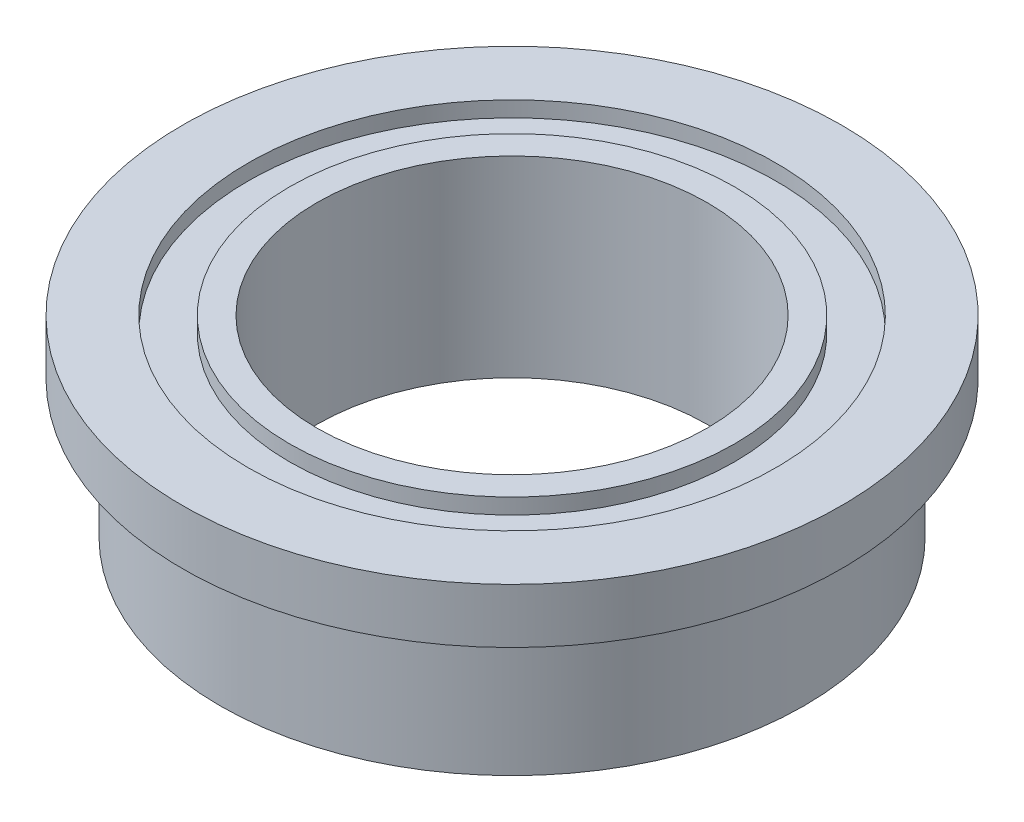
ISO-10303-21;
HEADER;
FILE_DESCRIPTION(('STEP AP214'),'2;1');
FILE_NAME('part.step','',(''),(''),'','','');
FILE_SCHEMA(('AUTOMOTIVE_DESIGN { 1 0 10303 214 1 1 1 1 }'));
ENDSEC;
DATA;
#1=APPLICATION_CONTEXT('core data for automotive mechanical design processes');
#2=APPLICATION_PROTOCOL_DEFINITION('international standard','automotive_design',2000,#1);
#3=PRODUCT_CONTEXT('',#1,'mechanical');
#4=PRODUCT('Part','Part','',(#3));
#5=PRODUCT_RELATED_PRODUCT_CATEGORY('part','',(#4));
#6=PRODUCT_DEFINITION_FORMATION('','',#4);
#7=PRODUCT_DEFINITION_CONTEXT('part definition',#1,'design');
#8=PRODUCT_DEFINITION('design','',#6,#7);
#9=PRODUCT_DEFINITION_SHAPE('','',#8);
#10=(LENGTH_UNIT() NAMED_UNIT(*) SI_UNIT(.MILLI.,.METRE.));
#11=(NAMED_UNIT(*) PLANE_ANGLE_UNIT() SI_UNIT($,.RADIAN.));
#12=(NAMED_UNIT(*) SI_UNIT($,.STERADIAN.) SOLID_ANGLE_UNIT());
#13=UNCERTAINTY_MEASURE_WITH_UNIT(LENGTH_MEASURE(1.E-05),#10,'distance_accuracy_value','');
#14=(GEOMETRIC_REPRESENTATION_CONTEXT(3) GLOBAL_UNCERTAINTY_ASSIGNED_CONTEXT((#13)) GLOBAL_UNIT_ASSIGNED_CONTEXT((#10,
#11,#12)) REPRESENTATION_CONTEXT('',''));
#15=CARTESIAN_POINT('',(0.,0.,0.));
#16=DIRECTION('',(0.,0.,1.));
#17=DIRECTION('',(1.,0.,0.));
#18=AXIS2_PLACEMENT_3D('',#15,#16,#17);
#19=CARTESIAN_POINT('',(0.,3.1242,0.));
#20=DIRECTION('',(0.,1.,0.));
#21=DIRECTION('',(0.,0.,1.));
#22=AXIS2_PLACEMENT_3D('',#19,#20,#21);
#23=PLANE('',#22);
#24=CARTESIAN_POINT('',(0.,3.1242,0.));
#25=DIRECTION('',(0.,1.,0.));
#26=DIRECTION('',(0.,0.,1.));
#27=AXIS2_PLACEMENT_3D('',#24,#25,#26);
#28=CIRCLE('',#27,3.6195);
#29=CARTESIAN_POINT('',(0.,3.1242,3.6195));
#30=VERTEX_POINT('',#29);
#31=EDGE_CURVE('E18',#30,#30,#28,.F.);
#32=ORIENTED_EDGE('',*,*,#31,.F.);
#33=EDGE_LOOP('',(#32));
#34=FACE_BOUND('',#33,.T.);
#35=CARTESIAN_POINT('',(0.,3.1242,0.));
#36=DIRECTION('',(0.,1.,0.));
#37=DIRECTION('',(0.,0.,1.));
#38=AXIS2_PLACEMENT_3D('',#35,#36,#37);
#39=CIRCLE('',#38,3.175);
#40=CARTESIAN_POINT('',(0.,3.1242,3.175));
#41=VERTEX_POINT('',#40);
#42=EDGE_CURVE('E58',#41,#41,#39,.F.);
#43=ORIENTED_EDGE('',*,*,#42,.T.);
#44=EDGE_LOOP('',(#43));
#45=FACE_BOUND('',#44,.T.);
#46=ADVANCED_FACE('F15',(#34,#45),#23,.T.);
#47=CARTESIAN_POINT('',(0.,2.8702,0.));
#48=DIRECTION('',(0.,1.,0.));
#49=DIRECTION('',(0.,0.,1.));
#50=AXIS2_PLACEMENT_3D('',#47,#48,#49);
#51=CYLINDRICAL_SURFACE('',#50,3.6195);
#52=CARTESIAN_POINT('',(0.,2.8702,0.));
#53=DIRECTION('',(0.,1.,0.));
#54=DIRECTION('',(0.,0.,1.));
#55=AXIS2_PLACEMENT_3D('',#52,#53,#54);
#56=CIRCLE('',#55,3.6195);
#57=CARTESIAN_POINT('',(0.,2.8702,3.6195));
#58=VERTEX_POINT('',#57);
#59=EDGE_CURVE('E56',#58,#58,#56,.F.);
#60=ORIENTED_EDGE('',*,*,#59,.F.);
#61=EDGE_LOOP('',(#60));
#62=FACE_BOUND('',#61,.T.);
#63=ORIENTED_EDGE('',*,*,#31,.T.);
#64=EDGE_LOOP('',(#63));
#65=FACE_BOUND('',#64,.T.);
#66=ADVANCED_FACE('F65',(#62,#65),#51,.T.);
#67=CARTESIAN_POINT('',(0.,0.,0.));
#68=DIRECTION('',(0.,1.,0.));
#69=DIRECTION('',(0.,0.,1.));
#70=AXIS2_PLACEMENT_3D('',#67,#68,#69);
#71=CYLINDRICAL_SURFACE('',#70,3.175);
#72=CARTESIAN_POINT('',(0.,0.,0.));
#73=DIRECTION('',(0.,1.,0.));
#74=DIRECTION('',(0.,0.,1.));
#75=AXIS2_PLACEMENT_3D('',#72,#73,#74);
#76=CIRCLE('',#75,3.175);
#77=CARTESIAN_POINT('',(0.,0.,3.175));
#78=VERTEX_POINT('',#77);
#79=EDGE_CURVE('E53',#78,#78,#76,.F.);
#80=ORIENTED_EDGE('',*,*,#79,.T.);
#81=EDGE_LOOP('',(#80));
#82=FACE_BOUND('',#81,.T.);
#83=ORIENTED_EDGE('',*,*,#42,.F.);
#84=EDGE_LOOP('',(#83));
#85=FACE_BOUND('',#84,.T.);
#86=ADVANCED_FACE('F71',(#82,#85),#71,.F.);
#87=CARTESIAN_POINT('',(0.,2.8702,0.));
#88=DIRECTION('',(0.,1.,0.));
#89=DIRECTION('',(0.,0.,1.));
#90=AXIS2_PLACEMENT_3D('',#87,#88,#89);
#91=PLANE('',#90);
#92=CARTESIAN_POINT('',(0.,2.8702,0.));
#93=DIRECTION('',(0.,1.,0.));
#94=DIRECTION('',(0.,0.,1.));
#95=AXIS2_PLACEMENT_3D('',#92,#93,#94);
#96=CIRCLE('',#95,4.2926);
#97=CARTESIAN_POINT('',(0.,2.8702,4.2926));
#98=VERTEX_POINT('',#97);
#99=EDGE_CURVE('E50',#98,#98,#96,.T.);
#100=ORIENTED_EDGE('',*,*,#99,.T.);
#101=EDGE_LOOP('',(#100));
#102=FACE_BOUND('',#101,.T.);
#103=ORIENTED_EDGE('',*,*,#59,.T.);
#104=EDGE_LOOP('',(#103));
#105=FACE_BOUND('',#104,.T.);
#106=ADVANCED_FACE('F115',(#102,#105),#91,.T.);
#107=CARTESIAN_POINT('',(0.,0.,0.));
#108=DIRECTION('',(0.,1.,0.));
#109=DIRECTION('',(0.,0.,1.));
#110=AXIS2_PLACEMENT_3D('',#107,#108,#109);
#111=PLANE('',#110);
#112=CARTESIAN_POINT('',(0.,0.,0.));
#113=DIRECTION('',(0.,-1.,0.));
#114=DIRECTION('',(0.,0.,-1.));
#115=AXIS2_PLACEMENT_3D('',#112,#113,#114);
#116=CIRCLE('',#115,3.6195);
#117=CARTESIAN_POINT('',(0.,0.,-3.6195));
#118=VERTEX_POINT('',#117);
#119=EDGE_CURVE('E47',#118,#118,#116,.F.);
#120=ORIENTED_EDGE('',*,*,#119,.F.);
#121=EDGE_LOOP('',(#120));
#122=FACE_BOUND('',#121,.T.);
#123=ORIENTED_EDGE('',*,*,#79,.F.);
#124=EDGE_LOOP('',(#123));
#125=FACE_BOUND('',#124,.T.);
#126=ADVANCED_FACE('F111',(#122,#125),#111,.F.);
#127=CARTESIAN_POINT('',(0.,2.8702,0.));
#128=DIRECTION('',(0.,1.,0.));
#129=DIRECTION('',(0.,0.,1.));
#130=AXIS2_PLACEMENT_3D('',#127,#128,#129);
#131=CYLINDRICAL_SURFACE('',#130,4.2926);
#132=CARTESIAN_POINT('',(0.,3.1242,0.));
#133=DIRECTION('',(0.,1.,0.));
#134=DIRECTION('',(0.,0.,1.));
#135=AXIS2_PLACEMENT_3D('',#132,#133,#134);
#136=CIRCLE('',#135,4.2926);
#137=CARTESIAN_POINT('',(0.,3.1242,4.2926));
#138=VERTEX_POINT('',#137);
#139=EDGE_CURVE('E44',#138,#138,#136,.F.);
#140=ORIENTED_EDGE('',*,*,#139,.F.);
#141=EDGE_LOOP('',(#140));
#142=FACE_BOUND('',#141,.T.);
#143=ORIENTED_EDGE('',*,*,#99,.F.);
#144=EDGE_LOOP('',(#143));
#145=FACE_BOUND('',#144,.T.);
#146=ADVANCED_FACE('F107',(#142,#145),#131,.F.);
#147=CARTESIAN_POINT('',(0.,0.254,0.));
#148=DIRECTION('',(0.,-1.,0.));
#149=DIRECTION('',(0.,0.,-1.));
#150=AXIS2_PLACEMENT_3D('',#147,#148,#149);
#151=CYLINDRICAL_SURFACE('',#150,3.6195);
#152=CARTESIAN_POINT('',(0.,0.254,0.));
#153=DIRECTION('',(0.,-1.,0.));
#154=DIRECTION('',(0.,0.,-1.));
#155=AXIS2_PLACEMENT_3D('',#152,#153,#154);
#156=CIRCLE('',#155,3.6195);
#157=CARTESIAN_POINT('',(0.,0.254,-3.6195));
#158=VERTEX_POINT('',#157);
#159=EDGE_CURVE('E41',#158,#158,#156,.F.);
#160=ORIENTED_EDGE('',*,*,#159,.F.);
#161=EDGE_LOOP('',(#160));
#162=FACE_BOUND('',#161,.T.);
#163=ORIENTED_EDGE('',*,*,#119,.T.);
#164=EDGE_LOOP('',(#163));
#165=FACE_BOUND('',#164,.T.);
#166=ADVANCED_FACE('F103',(#162,#165),#151,.T.);
#167=CARTESIAN_POINT('',(0.,3.1242,0.));
#168=DIRECTION('',(0.,1.,0.));
#169=DIRECTION('',(0.,0.,1.));
#170=AXIS2_PLACEMENT_3D('',#167,#168,#169);
#171=PLANE('',#170);
#172=CARTESIAN_POINT('',(0.,3.1242,0.));
#173=DIRECTION('',(0.,-1.,0.));
#174=DIRECTION('',(0.,0.,-1.));
#175=AXIS2_PLACEMENT_3D('',#172,#173,#174);
#176=CIRCLE('',#175,5.3594);
#177=CARTESIAN_POINT('',(0.,3.1242,-5.3594));
#178=VERTEX_POINT('',#177);
#179=EDGE_CURVE('E38',#178,#178,#176,.T.);
#180=ORIENTED_EDGE('',*,*,#179,.F.);
#181=EDGE_LOOP('',(#180));
#182=FACE_BOUND('',#181,.T.);
#183=ORIENTED_EDGE('',*,*,#139,.T.);
#184=EDGE_LOOP('',(#183));
#185=FACE_BOUND('',#184,.T.);
#186=ADVANCED_FACE('F99',(#182,#185),#171,.T.);
#187=CARTESIAN_POINT('',(0.,0.254,0.));
#188=DIRECTION('',(0.,-1.,0.));
#189=DIRECTION('',(0.,0.,-1.));
#190=AXIS2_PLACEMENT_3D('',#187,#188,#189);
#191=PLANE('',#190);
#192=CARTESIAN_POINT('',(0.,0.254,0.));
#193=DIRECTION('',(0.,-1.,0.));
#194=DIRECTION('',(0.,0.,-1.));
#195=AXIS2_PLACEMENT_3D('',#192,#193,#194);
#196=CIRCLE('',#195,4.2926);
#197=CARTESIAN_POINT('',(0.,0.254,-4.2926));
#198=VERTEX_POINT('',#197);
#199=EDGE_CURVE('E35',#198,#198,#196,.T.);
#200=ORIENTED_EDGE('',*,*,#199,.T.);
#201=EDGE_LOOP('',(#200));
#202=FACE_BOUND('',#201,.T.);
#203=ORIENTED_EDGE('',*,*,#159,.T.);
#204=EDGE_LOOP('',(#203));
#205=FACE_BOUND('',#204,.T.);
#206=ADVANCED_FACE('F95',(#202,#205),#191,.T.);
#207=CARTESIAN_POINT('',(0.,3.1242,0.));
#208=DIRECTION('',(0.,-1.,0.));
#209=DIRECTION('',(0.,0.,-1.));
#210=AXIS2_PLACEMENT_3D('',#207,#208,#209);
#211=CYLINDRICAL_SURFACE('',#210,5.3594);
#212=ORIENTED_EDGE('',*,*,#179,.T.);
#213=EDGE_LOOP('',(#212));
#214=FACE_BOUND('',#213,.T.);
#215=CARTESIAN_POINT('',(0.,2.2352,0.));
#216=DIRECTION('',(0.,-1.,0.));
#217=DIRECTION('',(0.,0.,-1.));
#218=AXIS2_PLACEMENT_3D('',#215,#216,#217);
#219=CIRCLE('',#218,5.3594);
#220=CARTESIAN_POINT('',(0.,2.2352,-5.3594));
#221=VERTEX_POINT('',#220);
#222=EDGE_CURVE('E32',#221,#221,#219,.F.);
#223=ORIENTED_EDGE('',*,*,#222,.T.);
#224=EDGE_LOOP('',(#223));
#225=FACE_BOUND('',#224,.T.);
#226=ADVANCED_FACE('F91',(#214,#225),#211,.T.);
#227=CARTESIAN_POINT('',(0.,0.254,0.));
#228=DIRECTION('',(0.,-1.,0.));
#229=DIRECTION('',(0.,0.,-1.));
#230=AXIS2_PLACEMENT_3D('',#227,#228,#229);
#231=CYLINDRICAL_SURFACE('',#230,4.2926);
#232=ORIENTED_EDGE('',*,*,#199,.F.);
#233=EDGE_LOOP('',(#232));
#234=FACE_BOUND('',#233,.T.);
#235=CARTESIAN_POINT('',(0.,0.,0.));
#236=DIRECTION('',(0.,-1.,0.));
#237=DIRECTION('',(0.,0.,-1.));
#238=AXIS2_PLACEMENT_3D('',#235,#236,#237);
#239=CIRCLE('',#238,4.2926);
#240=CARTESIAN_POINT('',(0.,0.,-4.2926));
#241=VERTEX_POINT('',#240);
#242=EDGE_CURVE('E27',#241,#241,#239,.T.);
#243=ORIENTED_EDGE('',*,*,#242,.T.);
#244=EDGE_LOOP('',(#243));
#245=FACE_BOUND('',#244,.T.);
#246=ADVANCED_FACE('F87',(#234,#245),#231,.F.);
#247=CARTESIAN_POINT('',(0.,2.2352,0.));
#248=DIRECTION('',(0.,1.,0.));
#249=DIRECTION('',(0.,0.,1.));
#250=AXIS2_PLACEMENT_3D('',#247,#248,#249);
#251=PLANE('',#250);
#252=CARTESIAN_POINT('',(0.,2.2352,0.));
#253=DIRECTION('',(0.,-1.,0.));
#254=DIRECTION('',(0.,0.,-1.));
#255=AXIS2_PLACEMENT_3D('',#252,#253,#254);
#256=CIRCLE('',#255,4.7498);
#257=CARTESIAN_POINT('',(0.,2.2352,-4.7498));
#258=VERTEX_POINT('',#257);
#259=EDGE_CURVE('E22',#258,#258,#256,.T.);
#260=ORIENTED_EDGE('',*,*,#259,.F.);
#261=EDGE_LOOP('',(#260));
#262=FACE_BOUND('',#261,.T.);
#263=ORIENTED_EDGE('',*,*,#222,.F.);
#264=EDGE_LOOP('',(#263));
#265=FACE_BOUND('',#264,.T.);
#266=ADVANCED_FACE('F80',(#262,#265),#251,.F.);
#267=CARTESIAN_POINT('',(0.,0.,0.));
#268=DIRECTION('',(0.,1.,0.));
#269=DIRECTION('',(0.,0.,1.));
#270=AXIS2_PLACEMENT_3D('',#267,#268,#269);
#271=PLANE('',#270);
#272=CARTESIAN_POINT('',(0.,0.,0.));
#273=DIRECTION('',(0.,-1.,0.));
#274=DIRECTION('',(0.,0.,-1.));
#275=AXIS2_PLACEMENT_3D('',#272,#273,#274);
#276=CIRCLE('',#275,4.7498);
#277=CARTESIAN_POINT('',(0.,0.,-4.7498));
#278=VERTEX_POINT('',#277);
#279=EDGE_CURVE('E9',#278,#278,#276,.F.);
#280=ORIENTED_EDGE('',*,*,#279,.F.);
#281=EDGE_LOOP('',(#280));
#282=FACE_BOUND('',#281,.T.);
#283=ORIENTED_EDGE('',*,*,#242,.F.);
#284=EDGE_LOOP('',(#283));
#285=FACE_BOUND('',#284,.T.);
#286=ADVANCED_FACE('F75',(#282,#285),#271,.F.);
#287=CARTESIAN_POINT('',(0.,2.2352,0.));
#288=DIRECTION('',(0.,-1.,0.));
#289=DIRECTION('',(0.,0.,-1.));
#290=AXIS2_PLACEMENT_3D('',#287,#288,#289);
#291=CYLINDRICAL_SURFACE('',#290,4.7498);
#292=ORIENTED_EDGE('',*,*,#279,.T.);
#293=EDGE_LOOP('',(#292));
#294=FACE_BOUND('',#293,.T.);
#295=ORIENTED_EDGE('',*,*,#259,.T.);
#296=EDGE_LOOP('',(#295));
#297=FACE_BOUND('',#296,.T.);
#298=ADVANCED_FACE('F73',(#294,#297),#291,.T.);
#299=CLOSED_SHELL('',(#46,#66,#86,#106,#126,#146,#166,#186,#206,#226,#246,#266,#286,#298));
#300=MANIFOLD_SOLID_BREP('B1',#299);
#301=ADVANCED_BREP_SHAPE_REPRESENTATION('',(#18,#300),#14);
#302=SHAPE_DEFINITION_REPRESENTATION(#9,#301);
ENDSEC;
END-ISO-10303-21;
